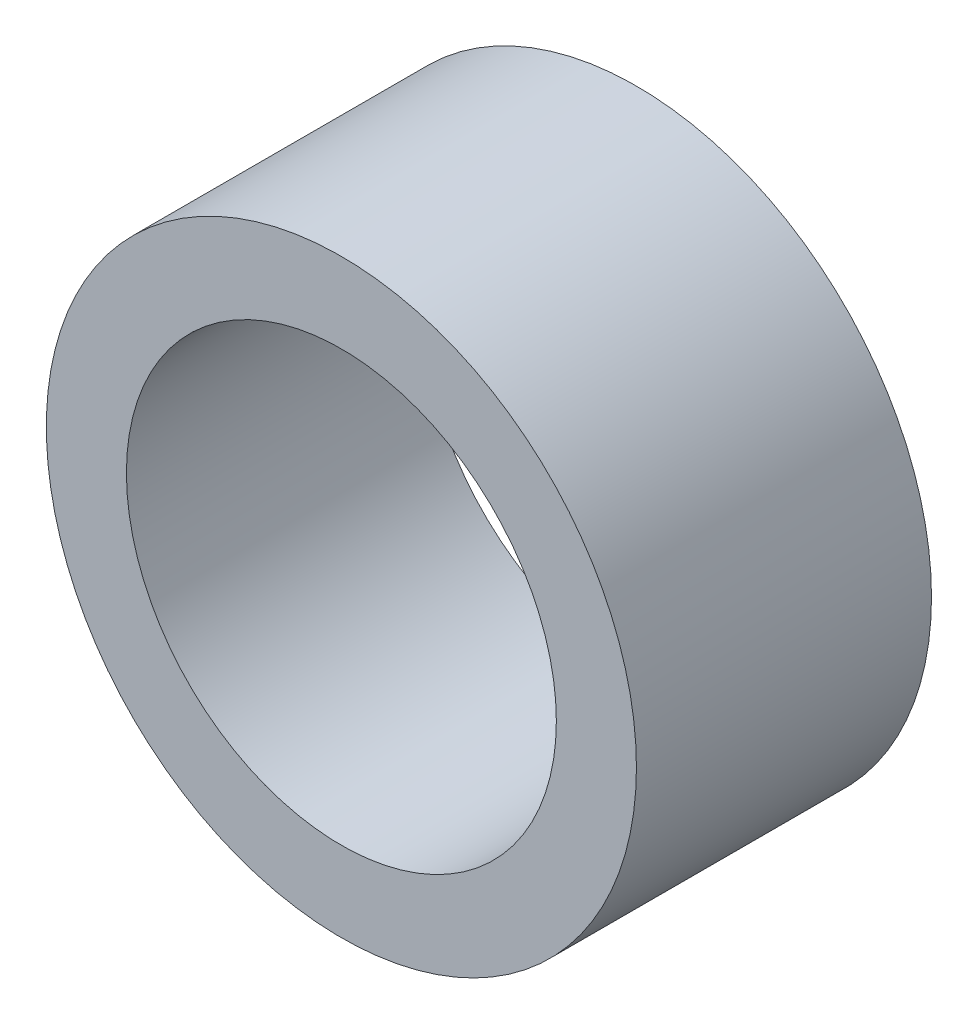
ISO-10303-21;
HEADER;
FILE_DESCRIPTION(('STEP AP214'),'2;1');
FILE_NAME('part.step','',(''),(''),'','','');
FILE_SCHEMA(('AUTOMOTIVE_DESIGN { 1 0 10303 214 1 1 1 1 }'));
ENDSEC;
DATA;
#1=APPLICATION_CONTEXT('core data for automotive mechanical design processes');
#2=APPLICATION_PROTOCOL_DEFINITION('international standard','automotive_design',2000,#1);
#3=PRODUCT_CONTEXT('',#1,'mechanical');
#4=PRODUCT('Part','Part','',(#3));
#5=PRODUCT_RELATED_PRODUCT_CATEGORY('part','',(#4));
#6=PRODUCT_DEFINITION_FORMATION('','',#4);
#7=PRODUCT_DEFINITION_CONTEXT('part definition',#1,'design');
#8=PRODUCT_DEFINITION('design','',#6,#7);
#9=PRODUCT_DEFINITION_SHAPE('','',#8);
#10=(LENGTH_UNIT() NAMED_UNIT(*) SI_UNIT(.MILLI.,.METRE.));
#11=(NAMED_UNIT(*) PLANE_ANGLE_UNIT() SI_UNIT($,.RADIAN.));
#12=(NAMED_UNIT(*) SI_UNIT($,.STERADIAN.) SOLID_ANGLE_UNIT());
#13=UNCERTAINTY_MEASURE_WITH_UNIT(LENGTH_MEASURE(1.E-05),#10,'distance_accuracy_value','');
#14=(GEOMETRIC_REPRESENTATION_CONTEXT(3) GLOBAL_UNCERTAINTY_ASSIGNED_CONTEXT((#13)) GLOBAL_UNIT_ASSIGNED_CONTEXT((#10,
#11,#12)) REPRESENTATION_CONTEXT('',''));
#15=CARTESIAN_POINT('',(0.,0.,0.));
#16=DIRECTION('',(0.,0.,1.));
#17=DIRECTION('',(1.,0.,0.));
#18=AXIS2_PLACEMENT_3D('',#15,#16,#17);
#19=CARTESIAN_POINT('',(0.,0.,-4.445));
#20=DIRECTION('',(0.,0.,1.));
#21=DIRECTION('',(1.,0.,0.));
#22=AXIS2_PLACEMENT_3D('',#19,#20,#21);
#23=CYLINDRICAL_SURFACE('',#22,4.445);
#24=CARTESIAN_POINT('',(0.,0.,-4.445));
#25=DIRECTION('',(0.,0.,1.));
#26=DIRECTION('',(1.,0.,0.));
#27=AXIS2_PLACEMENT_3D('',#24,#25,#26);
#28=CIRCLE('',#27,4.445);
#29=CARTESIAN_POINT('',(4.445,0.,-4.445));
#30=VERTEX_POINT('',#29);
#31=EDGE_CURVE('E10',#30,#30,#28,.T.);
#32=ORIENTED_EDGE('',*,*,#31,.T.);
#33=EDGE_LOOP('',(#32));
#34=FACE_BOUND('',#33,.T.);
#35=CARTESIAN_POINT('',(0.,0.,0.));
#36=DIRECTION('',(0.,0.,1.));
#37=DIRECTION('',(1.,0.,0.));
#38=AXIS2_PLACEMENT_3D('',#35,#36,#37);
#39=CIRCLE('',#38,4.445);
#40=CARTESIAN_POINT('',(4.445,0.,0.));
#41=VERTEX_POINT('',#40);
#42=EDGE_CURVE('E40',#41,#41,#39,.T.);
#43=ORIENTED_EDGE('',*,*,#42,.F.);
#44=EDGE_LOOP('',(#43));
#45=FACE_BOUND('',#44,.T.);
#46=ADVANCED_FACE('F37',(#34,#45),#23,.T.);
#47=CARTESIAN_POINT('',(0.,0.,-4.445));
#48=DIRECTION('',(0.,0.,1.));
#49=DIRECTION('',(1.,0.,0.));
#50=AXIS2_PLACEMENT_3D('',#47,#48,#49);
#51=PLANE('',#50);
#52=CARTESIAN_POINT('',(0.,0.,-4.445));
#53=DIRECTION('',(0.,0.,1.));
#54=DIRECTION('',(1.,0.,0.));
#55=AXIS2_PLACEMENT_3D('',#52,#53,#54);
#56=CIRCLE('',#55,3.2385);
#57=CARTESIAN_POINT('',(3.2385,0.,-4.445));
#58=VERTEX_POINT('',#57);
#59=EDGE_CURVE('E49',#58,#58,#56,.T.);
#60=ORIENTED_EDGE('',*,*,#59,.T.);
#61=EDGE_LOOP('',(#60));
#62=FACE_BOUND('',#61,.T.);
#63=ORIENTED_EDGE('',*,*,#31,.F.);
#64=EDGE_LOOP('',(#63));
#65=FACE_BOUND('',#64,.T.);
#66=ADVANCED_FACE('F59',(#62,#65),#51,.F.);
#67=CARTESIAN_POINT('',(0.,0.,0.));
#68=DIRECTION('',(0.,0.,1.));
#69=DIRECTION('',(1.,0.,0.));
#70=AXIS2_PLACEMENT_3D('',#67,#68,#69);
#71=PLANE('',#70);
#72=CARTESIAN_POINT('',(0.,0.,0.));
#73=DIRECTION('',(0.,0.,1.));
#74=DIRECTION('',(1.,0.,0.));
#75=AXIS2_PLACEMENT_3D('',#72,#73,#74);
#76=CIRCLE('',#75,3.2385);
#77=CARTESIAN_POINT('',(3.2385,0.,0.));
#78=VERTEX_POINT('',#77);
#79=EDGE_CURVE('E51',#78,#78,#76,.T.);
#80=ORIENTED_EDGE('',*,*,#79,.F.);
#81=EDGE_LOOP('',(#80));
#82=FACE_BOUND('',#81,.T.);
#83=ORIENTED_EDGE('',*,*,#42,.T.);
#84=EDGE_LOOP('',(#83));
#85=FACE_BOUND('',#84,.T.);
#86=ADVANCED_FACE('F65',(#82,#85),#71,.T.);
#87=CARTESIAN_POINT('',(0.,0.,-4.445));
#88=DIRECTION('',(0.,0.,1.));
#89=DIRECTION('',(1.,0.,0.));
#90=AXIS2_PLACEMENT_3D('',#87,#88,#89);
#91=CYLINDRICAL_SURFACE('',#90,3.2385);
#92=ORIENTED_EDGE('',*,*,#59,.F.);
#93=EDGE_LOOP('',(#92));
#94=FACE_BOUND('',#93,.T.);
#95=ORIENTED_EDGE('',*,*,#79,.T.);
#96=EDGE_LOOP('',(#95));
#97=FACE_BOUND('',#96,.T.);
#98=ADVANCED_FACE('F62',(#94,#97),#91,.F.);
#99=CLOSED_SHELL('',(#46,#66,#86,#98));
#100=MANIFOLD_SOLID_BREP('B2',#99);
#101=ADVANCED_BREP_SHAPE_REPRESENTATION('',(#18,#100),#14);
#102=SHAPE_DEFINITION_REPRESENTATION(#9,#101);
ENDSEC;
END-ISO-10303-21;
